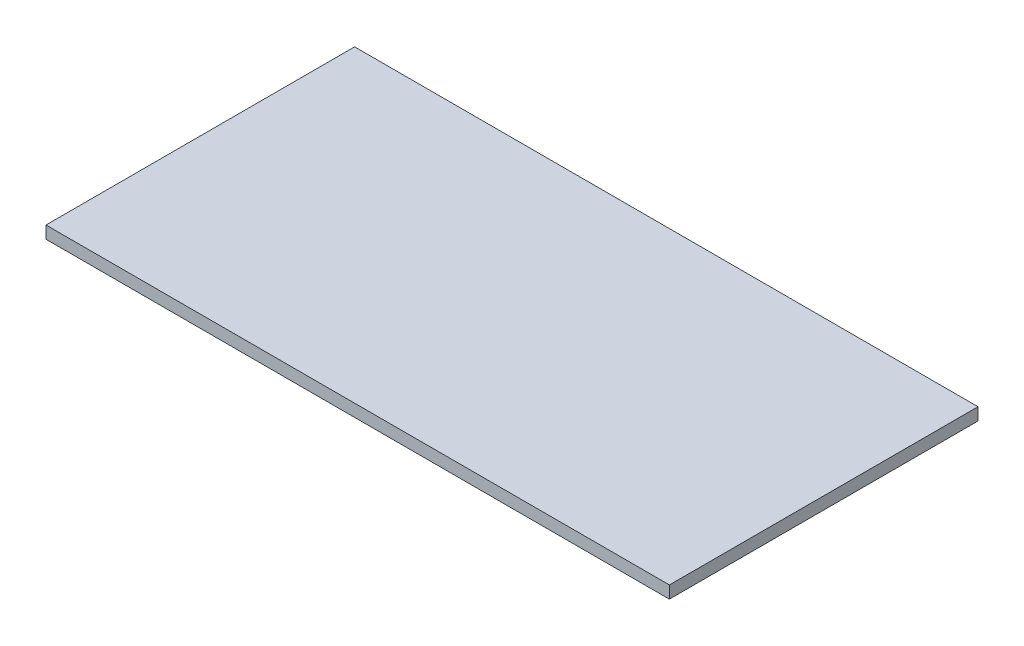
ISO-10303-21;
HEADER;
FILE_DESCRIPTION(('STEP AP214'),'2;1');
FILE_NAME('part.step','',(''),(''),'','','');
FILE_SCHEMA(('AUTOMOTIVE_DESIGN { 1 0 10303 214 1 1 1 1 }'));
ENDSEC;
DATA;
#1=APPLICATION_CONTEXT('core data for automotive mechanical design processes');
#2=APPLICATION_PROTOCOL_DEFINITION('international standard','automotive_design',2000,#1);
#3=PRODUCT_CONTEXT('',#1,'mechanical');
#4=PRODUCT('Part','Part','',(#3));
#5=PRODUCT_RELATED_PRODUCT_CATEGORY('part','',(#4));
#6=PRODUCT_DEFINITION_FORMATION('','',#4);
#7=PRODUCT_DEFINITION_CONTEXT('part definition',#1,'design');
#8=PRODUCT_DEFINITION('design','',#6,#7);
#9=PRODUCT_DEFINITION_SHAPE('','',#8);
#10=(LENGTH_UNIT() NAMED_UNIT(*) SI_UNIT(.MILLI.,.METRE.));
#11=(NAMED_UNIT(*) PLANE_ANGLE_UNIT() SI_UNIT($,.RADIAN.));
#12=(NAMED_UNIT(*) SI_UNIT($,.STERADIAN.) SOLID_ANGLE_UNIT());
#13=UNCERTAINTY_MEASURE_WITH_UNIT(LENGTH_MEASURE(1.E-05),#10,'distance_accuracy_value','');
#14=(GEOMETRIC_REPRESENTATION_CONTEXT(3) GLOBAL_UNCERTAINTY_ASSIGNED_CONTEXT((#13)) GLOBAL_UNIT_ASSIGNED_CONTEXT((#10,
#11,#12)) REPRESENTATION_CONTEXT('',''));
#15=CARTESIAN_POINT('',(0.,0.,0.));
#16=DIRECTION('',(0.,0.,1.));
#17=DIRECTION('',(1.,0.,0.));
#18=AXIS2_PLACEMENT_3D('',#15,#16,#17);
#19=CARTESIAN_POINT('',(320.675,12.7,158.75));
#20=DIRECTION('',(-1.,0.,0.));
#21=DIRECTION('',(0.,0.,1.));
#22=AXIS2_PLACEMENT_3D('',#19,#20,#21);
#23=PLANE('',#22);
#24=DIRECTION('',(0.,0.,-1.));
#25=VECTOR('',#24,1.);
#26=CARTESIAN_POINT('',(320.675,0.,158.75));
#27=LINE('',#26,#25);
#28=CARTESIAN_POINT('',(320.675,0.,158.75));
#29=VERTEX_POINT('',#28);
#30=CARTESIAN_POINT('',(320.675,0.,-158.75));
#31=VERTEX_POINT('',#30);
#32=EDGE_CURVE('E96',#29,#31,#27,.T.);
#33=ORIENTED_EDGE('',*,*,#32,.T.);
#34=DIRECTION('',(0.,-1.,0.));
#35=VECTOR('',#34,1.);
#36=CARTESIAN_POINT('',(320.675,12.7,-158.75));
#37=LINE('',#36,#35);
#38=CARTESIAN_POINT('',(320.675,12.7,-158.75));
#39=VERTEX_POINT('',#38);
#40=EDGE_CURVE('E11',#39,#31,#37,.T.);
#41=ORIENTED_EDGE('',*,*,#40,.F.);
#42=DIRECTION('',(0.,0.,-1.));
#43=VECTOR('',#42,1.);
#44=CARTESIAN_POINT('',(320.675,12.7,158.75));
#45=LINE('',#44,#43);
#46=CARTESIAN_POINT('',(320.675,12.7,158.75));
#47=VERTEX_POINT('',#46);
#48=EDGE_CURVE('E84',#47,#39,#45,.T.);
#49=ORIENTED_EDGE('',*,*,#48,.F.);
#50=DIRECTION('',(0.,-1.,0.));
#51=VECTOR('',#50,1.);
#52=CARTESIAN_POINT('',(320.675,12.7,158.75));
#53=LINE('',#52,#51);
#54=EDGE_CURVE('E92',#47,#29,#53,.T.);
#55=ORIENTED_EDGE('',*,*,#54,.T.);
#56=EDGE_LOOP('',(#33,#41,#49,#55));
#57=FACE_BOUND('',#56,.T.);
#58=ADVANCED_FACE('F33',(#57),#23,.F.);
#59=CARTESIAN_POINT('',(-320.675,12.7,-158.75));
#60=DIRECTION('',(0.,0.,1.));
#61=DIRECTION('',(1.,0.,0.));
#62=AXIS2_PLACEMENT_3D('',#59,#60,#61);
#63=PLANE('',#62);
#64=DIRECTION('',(-1.,0.,0.));
#65=VECTOR('',#64,1.);
#66=CARTESIAN_POINT('',(-320.675,0.,-158.75));
#67=LINE('',#66,#65);
#68=CARTESIAN_POINT('',(-320.675,0.,-158.75));
#69=VERTEX_POINT('',#68);
#70=EDGE_CURVE('E88',#31,#69,#67,.T.);
#71=ORIENTED_EDGE('',*,*,#70,.T.);
#72=DIRECTION('',(0.,-1.,0.));
#73=VECTOR('',#72,1.);
#74=CARTESIAN_POINT('',(-320.675,12.7,-158.75));
#75=LINE('',#74,#73);
#76=CARTESIAN_POINT('',(-320.675,12.7,-158.75));
#77=VERTEX_POINT('',#76);
#78=EDGE_CURVE('E41',#77,#69,#75,.T.);
#79=ORIENTED_EDGE('',*,*,#78,.F.);
#80=DIRECTION('',(-1.,0.,0.));
#81=VECTOR('',#80,1.);
#82=CARTESIAN_POINT('',(-320.675,12.7,-158.75));
#83=LINE('',#82,#81);
#84=EDGE_CURVE('E79',#39,#77,#83,.T.);
#85=ORIENTED_EDGE('',*,*,#84,.F.);
#86=ORIENTED_EDGE('',*,*,#40,.T.);
#87=EDGE_LOOP('',(#71,#79,#85,#86));
#88=FACE_BOUND('',#87,.T.);
#89=ADVANCED_FACE('F87',(#88),#63,.F.);
#90=CARTESIAN_POINT('',(-320.675,12.7,158.75));
#91=DIRECTION('',(1.,0.,0.));
#92=DIRECTION('',(0.,0.,-1.));
#93=AXIS2_PLACEMENT_3D('',#90,#91,#92);
#94=PLANE('',#93);
#95=DIRECTION('',(0.,0.,1.));
#96=VECTOR('',#95,1.);
#97=CARTESIAN_POINT('',(-320.675,0.,158.75));
#98=LINE('',#97,#96);
#99=CARTESIAN_POINT('',(-320.675,0.,158.75));
#100=VERTEX_POINT('',#99);
#101=EDGE_CURVE('E66',#69,#100,#98,.T.);
#102=ORIENTED_EDGE('',*,*,#101,.T.);
#103=DIRECTION('',(0.,-1.,0.));
#104=VECTOR('',#103,1.);
#105=CARTESIAN_POINT('',(-320.675,12.7,158.75));
#106=LINE('',#105,#104);
#107=CARTESIAN_POINT('',(-320.675,12.7,158.75));
#108=VERTEX_POINT('',#107);
#109=EDGE_CURVE('E89',#108,#100,#106,.T.);
#110=ORIENTED_EDGE('',*,*,#109,.F.);
#111=DIRECTION('',(0.,0.,1.));
#112=VECTOR('',#111,1.);
#113=CARTESIAN_POINT('',(-320.675,12.7,158.75));
#114=LINE('',#113,#112);
#115=EDGE_CURVE('E82',#77,#108,#114,.T.);
#116=ORIENTED_EDGE('',*,*,#115,.F.);
#117=ORIENTED_EDGE('',*,*,#78,.T.);
#118=EDGE_LOOP('',(#102,#110,#116,#117));
#119=FACE_BOUND('',#118,.T.);
#120=ADVANCED_FACE('F90',(#119),#94,.F.);
#121=CARTESIAN_POINT('',(-320.675,12.7,158.75));
#122=DIRECTION('',(0.,0.,-1.));
#123=DIRECTION('',(-1.,0.,0.));
#124=AXIS2_PLACEMENT_3D('',#121,#122,#123);
#125=PLANE('',#124);
#126=DIRECTION('',(1.,0.,0.));
#127=VECTOR('',#126,1.);
#128=CARTESIAN_POINT('',(-320.675,0.,158.75));
#129=LINE('',#128,#127);
#130=EDGE_CURVE('E72',#100,#29,#129,.T.);
#131=ORIENTED_EDGE('',*,*,#130,.T.);
#132=ORIENTED_EDGE('',*,*,#54,.F.);
#133=DIRECTION('',(1.,0.,0.));
#134=VECTOR('',#133,1.);
#135=CARTESIAN_POINT('',(-320.675,12.7,158.75));
#136=LINE('',#135,#134);
#137=EDGE_CURVE('E49',#108,#47,#136,.T.);
#138=ORIENTED_EDGE('',*,*,#137,.F.);
#139=ORIENTED_EDGE('',*,*,#109,.T.);
#140=EDGE_LOOP('',(#131,#132,#138,#139));
#141=FACE_BOUND('',#140,.T.);
#142=ADVANCED_FACE('F103',(#141),#125,.F.);
#143=CARTESIAN_POINT('',(0.,12.7,0.));
#144=DIRECTION('',(0.,-1.,0.));
#145=DIRECTION('',(0.,0.,-1.));
#146=AXIS2_PLACEMENT_3D('',#143,#144,#145);
#147=PLANE('',#146);
#148=ORIENTED_EDGE('',*,*,#48,.T.);
#149=ORIENTED_EDGE('',*,*,#84,.T.);
#150=ORIENTED_EDGE('',*,*,#115,.T.);
#151=ORIENTED_EDGE('',*,*,#137,.T.);
#152=EDGE_LOOP('',(#148,#149,#150,#151));
#153=FACE_BOUND('',#152,.T.);
#154=ADVANCED_FACE('F80',(#153),#147,.F.);
#155=CARTESIAN_POINT('',(0.,0.,0.));
#156=DIRECTION('',(0.,-1.,0.));
#157=DIRECTION('',(0.,0.,-1.));
#158=AXIS2_PLACEMENT_3D('',#155,#156,#157);
#159=PLANE('',#158);
#160=ORIENTED_EDGE('',*,*,#32,.F.);
#161=ORIENTED_EDGE('',*,*,#130,.F.);
#162=ORIENTED_EDGE('',*,*,#101,.F.);
#163=ORIENTED_EDGE('',*,*,#70,.F.);
#164=EDGE_LOOP('',(#160,#161,#162,#163));
#165=FACE_BOUND('',#164,.T.);
#166=ADVANCED_FACE('F106',(#165),#159,.T.);
#167=CLOSED_SHELL('',(#58,#89,#120,#142,#154,#166));
#168=MANIFOLD_SOLID_BREP('B2',#167);
#169=ADVANCED_BREP_SHAPE_REPRESENTATION('',(#18,#168),#14);
#170=SHAPE_DEFINITION_REPRESENTATION(#9,#169);
ENDSEC;
END-ISO-10303-21;
